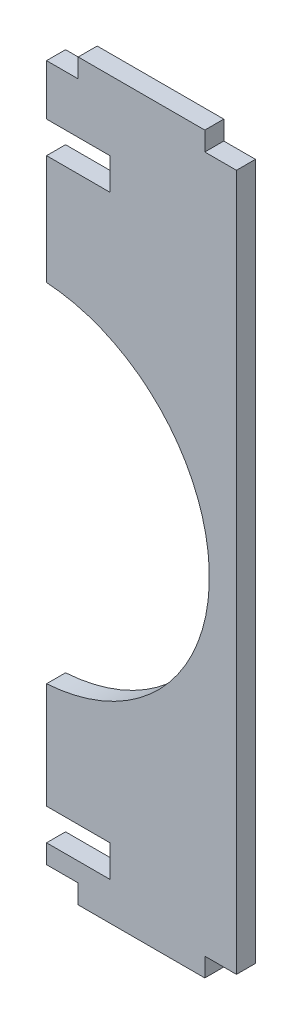
ISO-10303-21;
HEADER;
FILE_DESCRIPTION(('STEP AP214'),'2;1');
FILE_NAME('part.step','',(''),(''),'','','');
FILE_SCHEMA(('AUTOMOTIVE_DESIGN { 1 0 10303 214 1 1 1 1 }'));
ENDSEC;
DATA;
#1=APPLICATION_CONTEXT('core data for automotive mechanical design processes');
#2=APPLICATION_PROTOCOL_DEFINITION('international standard','automotive_design',2000,#1);
#3=PRODUCT_CONTEXT('',#1,'mechanical');
#4=PRODUCT('Part','Part','',(#3));
#5=PRODUCT_RELATED_PRODUCT_CATEGORY('part','',(#4));
#6=PRODUCT_DEFINITION_FORMATION('','',#4);
#7=PRODUCT_DEFINITION_CONTEXT('part definition',#1,'design');
#8=PRODUCT_DEFINITION('design','',#6,#7);
#9=PRODUCT_DEFINITION_SHAPE('','',#8);
#10=(LENGTH_UNIT() NAMED_UNIT(*) SI_UNIT(.MILLI.,.METRE.));
#11=(NAMED_UNIT(*) PLANE_ANGLE_UNIT() SI_UNIT($,.RADIAN.));
#12=(NAMED_UNIT(*) SI_UNIT($,.STERADIAN.) SOLID_ANGLE_UNIT());
#13=UNCERTAINTY_MEASURE_WITH_UNIT(LENGTH_MEASURE(1.E-05),#10,'distance_accuracy_value','');
#14=(GEOMETRIC_REPRESENTATION_CONTEXT(3) GLOBAL_UNCERTAINTY_ASSIGNED_CONTEXT((#13)) GLOBAL_UNIT_ASSIGNED_CONTEXT((#10,
#11,#12)) REPRESENTATION_CONTEXT('',''));
#15=CARTESIAN_POINT('',(0.,0.,0.));
#16=DIRECTION('',(0.,0.,1.));
#17=DIRECTION('',(1.,0.,0.));
#18=AXIS2_PLACEMENT_3D('',#15,#16,#17);
#19=CARTESIAN_POINT('',(-29.9999999999994,-3.00000000000271,3.));
#20=DIRECTION('',(1.,0.,0.));
#21=DIRECTION('',(0.,1.,0.));
#22=AXIS2_PLACEMENT_3D('',#19,#20,#21);
#23=PLANE('',#22);
#24=DIRECTION('',(0.,-1.,0.));
#25=VECTOR('',#24,1.);
#26=CARTESIAN_POINT('',(-29.9999999999994,-3.00000000000271,0.));
#27=LINE('',#26,#25);
#28=CARTESIAN_POINT('',(-29.9999999999994,-3.00000000000271,0.));
#29=VERTEX_POINT('',#28);
#30=CARTESIAN_POINT('',(-30.,-11.000000000005,0.));
#31=VERTEX_POINT('',#30);
#32=EDGE_CURVE('E208',#29,#31,#27,.T.);
#33=ORIENTED_EDGE('',*,*,#32,.T.);
#34=DIRECTION('',(0.,0.,1.));
#35=VECTOR('',#34,1.);
#36=CARTESIAN_POINT('',(-30.,-11.000000000005,0.));
#37=LINE('',#36,#35);
#38=CARTESIAN_POINT('',(-30.,-11.000000000005,3.));
#39=VERTEX_POINT('',#38);
#40=EDGE_CURVE('E289',#31,#39,#37,.T.);
#41=ORIENTED_EDGE('',*,*,#40,.T.);
#42=DIRECTION('',(0.,-1.,0.));
#43=VECTOR('',#42,1.);
#44=CARTESIAN_POINT('',(-29.9999999999994,-3.00000000000271,3.));
#45=LINE('',#44,#43);
#46=CARTESIAN_POINT('',(-29.9999999999994,-3.00000000000271,3.));
#47=VERTEX_POINT('',#46);
#48=EDGE_CURVE('E291',#47,#39,#45,.T.);
#49=ORIENTED_EDGE('',*,*,#48,.F.);
#50=DIRECTION('',(0.,0.,-1.));
#51=VECTOR('',#50,1.);
#52=CARTESIAN_POINT('',(-29.9999999999994,-3.00000000000271,3.));
#53=LINE('',#52,#51);
#54=EDGE_CURVE('E271',#47,#29,#53,.T.);
#55=ORIENTED_EDGE('',*,*,#54,.T.);
#56=EDGE_LOOP('',(#33,#41,#49,#55));
#57=FACE_BOUND('',#56,.T.);
#58=ADVANCED_FACE('F36',(#57),#23,.F.);
#59=CARTESIAN_POINT('',(-29.9999999999994,-113.000000000004,3.));
#60=DIRECTION('',(1.,0.,0.));
#61=DIRECTION('',(0.,1.,0.));
#62=AXIS2_PLACEMENT_3D('',#59,#60,#61);
#63=PLANE('',#62);
#64=DIRECTION('',(0.,-1.,0.));
#65=VECTOR('',#64,1.);
#66=CARTESIAN_POINT('',(-29.9999999999994,-113.000000000004,0.));
#67=LINE('',#66,#65);
#68=CARTESIAN_POINT('',(-29.9999999999997,-88.2435270209479,0.));
#69=VERTEX_POINT('',#68);
#70=CARTESIAN_POINT('',(-30.,-105.000000000003,0.));
#71=VERTEX_POINT('',#70);
#72=EDGE_CURVE('E218',#69,#71,#67,.T.);
#73=ORIENTED_EDGE('',*,*,#72,.T.);
#74=DIRECTION('',(0.,0.,1.));
#75=VECTOR('',#74,1.);
#76=CARTESIAN_POINT('',(-30.,-105.000000000003,0.));
#77=LINE('',#76,#75);
#78=CARTESIAN_POINT('',(-30.,-105.000000000003,3.));
#79=VERTEX_POINT('',#78);
#80=EDGE_CURVE('E321',#71,#79,#77,.T.);
#81=ORIENTED_EDGE('',*,*,#80,.T.);
#82=DIRECTION('',(0.,-1.,0.));
#83=VECTOR('',#82,1.);
#84=CARTESIAN_POINT('',(-29.9999999999994,-113.000000000004,3.));
#85=LINE('',#84,#83);
#86=CARTESIAN_POINT('',(-29.9999999999997,-88.2435270209479,3.));
#87=VERTEX_POINT('',#86);
#88=EDGE_CURVE('E301',#87,#79,#85,.T.);
#89=ORIENTED_EDGE('',*,*,#88,.F.);
#90=DIRECTION('',(0.,0.,-1.));
#91=VECTOR('',#90,1.);
#92=CARTESIAN_POINT('',(-29.9999999999997,-88.2435270209479,3.));
#93=LINE('',#92,#91);
#94=EDGE_CURVE('E266',#87,#69,#93,.T.);
#95=ORIENTED_EDGE('',*,*,#94,.T.);
#96=EDGE_LOOP('',(#73,#81,#89,#95));
#97=FACE_BOUND('',#96,.T.);
#98=ADVANCED_FACE('F413',(#97),#63,.F.);
#99=CARTESIAN_POINT('',(-5.00000000000001,0.,3.));
#100=DIRECTION('',(1.44009232012709E-13,-1.,0.));
#101=DIRECTION('',(1.,1.44009232012709E-13,0.));
#102=AXIS2_PLACEMENT_3D('',#99,#100,#101);
#103=PLANE('',#102);
#104=DIRECTION('',(-1.,-1.44009232012709E-13,0.));
#105=VECTOR('',#104,1.);
#106=CARTESIAN_POINT('',(-5.00000000000001,0.,0.));
#107=LINE('',#106,#105);
#108=CARTESIAN_POINT('',(-5.00000000000001,0.,0.));
#109=VERTEX_POINT('',#108);
#110=CARTESIAN_POINT('',(-24.9999999999994,-2.88018464025411E-12,0.));
#111=VERTEX_POINT('',#110);
#112=EDGE_CURVE('E319',#109,#111,#107,.T.);
#113=ORIENTED_EDGE('',*,*,#112,.T.);
#114=DIRECTION('',(0.,0.,-1.));
#115=VECTOR('',#114,1.);
#116=CARTESIAN_POINT('',(-24.9999999999994,-2.88018464025411E-12,3.));
#117=LINE('',#116,#115);
#118=CARTESIAN_POINT('',(-24.9999999999994,-2.88018464025411E-12,3.));
#119=VERTEX_POINT('',#118);
#120=EDGE_CURVE('E11',#119,#111,#117,.T.);
#121=ORIENTED_EDGE('',*,*,#120,.F.);
#122=DIRECTION('',(-1.,-1.44009232012709E-13,0.));
#123=VECTOR('',#122,1.);
#124=CARTESIAN_POINT('',(-5.00000000000001,0.,3.));
#125=LINE('',#124,#123);
#126=CARTESIAN_POINT('',(-5.00000000000001,0.,3.));
#127=VERTEX_POINT('',#126);
#128=EDGE_CURVE('E237',#127,#119,#125,.T.);
#129=ORIENTED_EDGE('',*,*,#128,.F.);
#130=DIRECTION('',(0.,0.,-1.));
#131=VECTOR('',#130,1.);
#132=CARTESIAN_POINT('',(-5.00000000000001,0.,3.));
#133=LINE('',#132,#131);
#134=EDGE_CURVE('E238',#127,#109,#133,.T.);
#135=ORIENTED_EDGE('',*,*,#134,.T.);
#136=EDGE_LOOP('',(#113,#121,#129,#135));
#137=FACE_BOUND('',#136,.T.);
#138=ADVANCED_FACE('F38',(#137),#103,.F.);
#139=CARTESIAN_POINT('',(-24.9999999999994,-2.88018464025411E-12,3.));
#140=DIRECTION('',(1.,0.,0.));
#141=DIRECTION('',(0.,0.,-1.));
#142=AXIS2_PLACEMENT_3D('',#139,#140,#141);
#143=PLANE('',#142);
#144=DIRECTION('',(0.,-1.,0.));
#145=VECTOR('',#144,1.);
#146=CARTESIAN_POINT('',(-24.9999999999994,-2.88018464025411E-12,0.));
#147=LINE('',#146,#145);
#148=CARTESIAN_POINT('',(-24.9999999999994,-3.00000000000271,0.));
#149=VERTEX_POINT('',#148);
#150=EDGE_CURVE('E212',#111,#149,#147,.T.);
#151=ORIENTED_EDGE('',*,*,#150,.T.);
#152=DIRECTION('',(0.,0.,-1.));
#153=VECTOR('',#152,1.);
#154=CARTESIAN_POINT('',(-24.9999999999994,-3.00000000000271,3.));
#155=LINE('',#154,#153);
#156=CARTESIAN_POINT('',(-24.9999999999994,-3.00000000000271,3.));
#157=VERTEX_POINT('',#156);
#158=EDGE_CURVE('E44',#157,#149,#155,.T.);
#159=ORIENTED_EDGE('',*,*,#158,.F.);
#160=DIRECTION('',(0.,-1.,0.));
#161=VECTOR('',#160,1.);
#162=CARTESIAN_POINT('',(-24.9999999999994,-2.88018464025411E-12,3.));
#163=LINE('',#162,#161);
#164=EDGE_CURVE('E324',#119,#157,#163,.T.);
#165=ORIENTED_EDGE('',*,*,#164,.F.);
#166=ORIENTED_EDGE('',*,*,#120,.T.);
#167=EDGE_LOOP('',(#151,#159,#165,#166));
#168=FACE_BOUND('',#167,.T.);
#169=ADVANCED_FACE('F322',(#168),#143,.F.);
#170=CARTESIAN_POINT('',(-24.9999999999994,-3.00000000000271,3.));
#171=DIRECTION('',(0.,-1.,0.));
#172=DIRECTION('',(1.,0.,0.));
#173=AXIS2_PLACEMENT_3D('',#170,#171,#172);
#174=PLANE('',#173);
#175=DIRECTION('',(-1.,0.,0.));
#176=VECTOR('',#175,1.);
#177=CARTESIAN_POINT('',(-24.9999999999994,-3.00000000000271,0.));
#178=LINE('',#177,#176);
#179=EDGE_CURVE('E209',#149,#29,#178,.T.);
#180=ORIENTED_EDGE('',*,*,#179,.T.);
#181=ORIENTED_EDGE('',*,*,#54,.F.);
#182=DIRECTION('',(-1.,0.,0.));
#183=VECTOR('',#182,1.);
#184=CARTESIAN_POINT('',(-24.9999999999994,-3.00000000000271,3.));
#185=LINE('',#184,#183);
#186=EDGE_CURVE('E280',#157,#47,#185,.T.);
#187=ORIENTED_EDGE('',*,*,#186,.F.);
#188=ORIENTED_EDGE('',*,*,#158,.T.);
#189=EDGE_LOOP('',(#180,#181,#187,#188));
#190=FACE_BOUND('',#189,.T.);
#191=ADVANCED_FACE('F278',(#190),#174,.F.);
#192=CARTESIAN_POINT('',(-30.,-16.000000000005,3.));
#193=VERTEX_POINT('',#192);
#194=CARTESIAN_POINT('',(-30.,-33.3589544228306,3.));
#195=VERTEX_POINT('',#194);
#196=EDGE_CURVE('E201',#193,#195,#45,.T.);
#197=ORIENTED_EDGE('',*,*,#196,.F.);
#198=DIRECTION('',(0.,0.,1.));
#199=VECTOR('',#198,1.);
#200=CARTESIAN_POINT('',(-30.,-16.000000000005,0.));
#201=LINE('',#200,#199);
#202=CARTESIAN_POINT('',(-30.,-16.000000000005,0.));
#203=VERTEX_POINT('',#202);
#204=EDGE_CURVE('E188',#203,#193,#201,.T.);
#205=ORIENTED_EDGE('',*,*,#204,.F.);
#206=CARTESIAN_POINT('',(-30.,-33.3589544228306,0.));
#207=VERTEX_POINT('',#206);
#208=EDGE_CURVE('E199',#203,#207,#27,.T.);
#209=ORIENTED_EDGE('',*,*,#208,.T.);
#210=DIRECTION('',(0.,0.,-1.));
#211=VECTOR('',#210,1.);
#212=CARTESIAN_POINT('',(-30.,-33.3589544228306,3.));
#213=LINE('',#212,#211);
#214=EDGE_CURVE('E269',#195,#207,#213,.T.);
#215=ORIENTED_EDGE('',*,*,#214,.F.);
#216=EDGE_LOOP('',(#197,#205,#209,#215));
#217=FACE_BOUND('',#216,.T.);
#218=ADVANCED_FACE('F197',(#217),#23,.F.);
#219=CARTESIAN_POINT('',(-31.7807084771232,-60.8012407218892,3.));
#220=DIRECTION('',(0.,0.,-1.));
#221=DIRECTION('',(-1.,0.,0.));
#222=AXIS2_PLACEMENT_3D('',#219,#220,#221);
#223=CYLINDRICAL_SURFACE('',#222,27.5);
#224=CARTESIAN_POINT('',(-31.7807084771232,-60.8012407218892,0.));
#225=DIRECTION('',(0.,0.,-1.));
#226=DIRECTION('',(1.,0.,0.));
#227=AXIS2_PLACEMENT_3D('',#224,#225,#226);
#228=CIRCLE('',#227,27.5);
#229=EDGE_CURVE('E207',#207,#69,#228,.T.);
#230=ORIENTED_EDGE('',*,*,#229,.T.);
#231=ORIENTED_EDGE('',*,*,#94,.F.);
#232=CARTESIAN_POINT('',(-31.7807084771232,-60.8012407218892,3.));
#233=DIRECTION('',(0.,0.,-1.));
#234=DIRECTION('',(1.,0.,0.));
#235=AXIS2_PLACEMENT_3D('',#232,#233,#234);
#236=CIRCLE('',#235,27.5);
#237=EDGE_CURVE('E294',#195,#87,#236,.T.);
#238=ORIENTED_EDGE('',*,*,#237,.F.);
#239=ORIENTED_EDGE('',*,*,#214,.T.);
#240=EDGE_LOOP('',(#230,#231,#238,#239));
#241=FACE_BOUND('',#240,.T.);
#242=ADVANCED_FACE('F423',(#241),#223,.F.);
#243=CARTESIAN_POINT('',(-30.,-110.000000000003,3.));
#244=VERTEX_POINT('',#243);
#245=CARTESIAN_POINT('',(-29.9999999999994,-113.000000000004,3.));
#246=VERTEX_POINT('',#245);
#247=EDGE_CURVE('E296',#244,#246,#85,.T.);
#248=ORIENTED_EDGE('',*,*,#247,.F.);
#249=DIRECTION('',(0.,0.,1.));
#250=VECTOR('',#249,1.);
#251=CARTESIAN_POINT('',(-30.,-110.000000000003,0.));
#252=LINE('',#251,#250);
#253=CARTESIAN_POINT('',(-30.,-110.000000000003,0.));
#254=VERTEX_POINT('',#253);
#255=EDGE_CURVE('E374',#254,#244,#252,.T.);
#256=ORIENTED_EDGE('',*,*,#255,.F.);
#257=CARTESIAN_POINT('',(-29.9999999999994,-113.000000000004,0.));
#258=VERTEX_POINT('',#257);
#259=EDGE_CURVE('E217',#254,#258,#67,.T.);
#260=ORIENTED_EDGE('',*,*,#259,.T.);
#261=DIRECTION('',(0.,0.,-1.));
#262=VECTOR('',#261,1.);
#263=CARTESIAN_POINT('',(-29.9999999999994,-113.000000000004,3.));
#264=LINE('',#263,#262);
#265=EDGE_CURVE('E263',#246,#258,#264,.T.);
#266=ORIENTED_EDGE('',*,*,#265,.F.);
#267=EDGE_LOOP('',(#248,#256,#260,#266));
#268=FACE_BOUND('',#267,.T.);
#269=ADVANCED_FACE('F372',(#268),#63,.F.);
#270=CARTESIAN_POINT('',(-24.9999999999994,-113.000000000004,3.));
#271=DIRECTION('',(0.,1.,0.));
#272=DIRECTION('',(0.,0.,1.));
#273=AXIS2_PLACEMENT_3D('',#270,#271,#272);
#274=PLANE('',#273);
#275=DIRECTION('',(1.,0.,0.));
#276=VECTOR('',#275,1.);
#277=CARTESIAN_POINT('',(-24.9999999999994,-113.000000000004,0.));
#278=LINE('',#277,#276);
#279=CARTESIAN_POINT('',(-24.9999999999994,-113.000000000004,0.));
#280=VERTEX_POINT('',#279);
#281=EDGE_CURVE('E221',#258,#280,#278,.T.);
#282=ORIENTED_EDGE('',*,*,#281,.T.);
#283=DIRECTION('',(0.,0.,-1.));
#284=VECTOR('',#283,1.);
#285=CARTESIAN_POINT('',(-24.9999999999994,-113.000000000004,3.));
#286=LINE('',#285,#284);
#287=CARTESIAN_POINT('',(-24.9999999999994,-113.000000000004,3.));
#288=VERTEX_POINT('',#287);
#289=EDGE_CURVE('E260',#288,#280,#286,.T.);
#290=ORIENTED_EDGE('',*,*,#289,.F.);
#291=DIRECTION('',(1.,0.,0.));
#292=VECTOR('',#291,1.);
#293=CARTESIAN_POINT('',(-24.9999999999994,-113.000000000004,3.));
#294=LINE('',#293,#292);
#295=EDGE_CURVE('E304',#246,#288,#294,.T.);
#296=ORIENTED_EDGE('',*,*,#295,.F.);
#297=ORIENTED_EDGE('',*,*,#265,.T.);
#298=EDGE_LOOP('',(#282,#290,#296,#297));
#299=FACE_BOUND('',#298,.T.);
#300=ADVANCED_FACE('F368',(#299),#274,.F.);
#301=CARTESIAN_POINT('',(-24.9999999999994,-116.000000000004,3.));
#302=DIRECTION('',(1.,0.,0.));
#303=DIRECTION('',(0.,1.,0.));
#304=AXIS2_PLACEMENT_3D('',#301,#302,#303);
#305=PLANE('',#304);
#306=DIRECTION('',(0.,-1.,0.));
#307=VECTOR('',#306,1.);
#308=CARTESIAN_POINT('',(-24.9999999999994,-116.000000000004,0.));
#309=LINE('',#308,#307);
#310=CARTESIAN_POINT('',(-24.9999999999994,-116.000000000004,0.));
#311=VERTEX_POINT('',#310);
#312=EDGE_CURVE('E223',#280,#311,#309,.T.);
#313=ORIENTED_EDGE('',*,*,#312,.T.);
#314=DIRECTION('',(0.,0.,-1.));
#315=VECTOR('',#314,1.);
#316=CARTESIAN_POINT('',(-24.9999999999994,-116.000000000004,3.));
#317=LINE('',#316,#315);
#318=CARTESIAN_POINT('',(-24.9999999999994,-116.000000000004,3.));
#319=VERTEX_POINT('',#318);
#320=EDGE_CURVE('E257',#319,#311,#317,.T.);
#321=ORIENTED_EDGE('',*,*,#320,.F.);
#322=DIRECTION('',(0.,-1.,0.));
#323=VECTOR('',#322,1.);
#324=CARTESIAN_POINT('',(-24.9999999999994,-116.000000000004,3.));
#325=LINE('',#324,#323);
#326=EDGE_CURVE('E306',#288,#319,#325,.T.);
#327=ORIENTED_EDGE('',*,*,#326,.F.);
#328=ORIENTED_EDGE('',*,*,#289,.T.);
#329=EDGE_LOOP('',(#313,#321,#327,#328));
#330=FACE_BOUND('',#329,.T.);
#331=ADVANCED_FACE('F363',(#330),#305,.F.);
#332=CARTESIAN_POINT('',(-4.99999999999936,-116.000000000004,3.));
#333=DIRECTION('',(0.,1.,0.));
#334=DIRECTION('',(0.,0.,1.));
#335=AXIS2_PLACEMENT_3D('',#332,#333,#334);
#336=PLANE('',#335);
#337=DIRECTION('',(1.,0.,0.));
#338=VECTOR('',#337,1.);
#339=CARTESIAN_POINT('',(-4.99999999999936,-116.000000000004,0.));
#340=LINE('',#339,#338);
#341=CARTESIAN_POINT('',(-4.99999999999936,-116.000000000004,0.));
#342=VERTEX_POINT('',#341);
#343=EDGE_CURVE('E225',#311,#342,#340,.T.);
#344=ORIENTED_EDGE('',*,*,#343,.T.);
#345=DIRECTION('',(0.,0.,-1.));
#346=VECTOR('',#345,1.);
#347=CARTESIAN_POINT('',(-4.99999999999936,-116.000000000004,3.));
#348=LINE('',#347,#346);
#349=CARTESIAN_POINT('',(-4.99999999999936,-116.000000000004,3.));
#350=VERTEX_POINT('',#349);
#351=EDGE_CURVE('E254',#350,#342,#348,.T.);
#352=ORIENTED_EDGE('',*,*,#351,.F.);
#353=DIRECTION('',(1.,0.,0.));
#354=VECTOR('',#353,1.);
#355=CARTESIAN_POINT('',(-4.99999999999936,-116.000000000004,3.));
#356=LINE('',#355,#354);
#357=EDGE_CURVE('E308',#319,#350,#356,.T.);
#358=ORIENTED_EDGE('',*,*,#357,.F.);
#359=ORIENTED_EDGE('',*,*,#320,.T.);
#360=EDGE_LOOP('',(#344,#352,#358,#359));
#361=FACE_BOUND('',#360,.T.);
#362=ADVANCED_FACE('F357',(#361),#336,.F.);
#363=CARTESIAN_POINT('',(-4.99999999999936,-113.00815233073,3.));
#364=DIRECTION('',(-1.,0.,0.));
#365=DIRECTION('',(0.,0.,1.));
#366=AXIS2_PLACEMENT_3D('',#363,#364,#365);
#367=PLANE('',#366);
#368=DIRECTION('',(0.,1.,0.));
#369=VECTOR('',#368,1.);
#370=CARTESIAN_POINT('',(-4.99999999999936,-113.00815233073,0.));
#371=LINE('',#370,#369);
#372=CARTESIAN_POINT('',(-4.99999999999936,-113.00815233073,0.));
#373=VERTEX_POINT('',#372);
#374=EDGE_CURVE('E227',#342,#373,#371,.T.);
#375=ORIENTED_EDGE('',*,*,#374,.T.);
#376=DIRECTION('',(0.,0.,-1.));
#377=VECTOR('',#376,1.);
#378=CARTESIAN_POINT('',(-4.99999999999936,-113.00815233073,3.));
#379=LINE('',#378,#377);
#380=CARTESIAN_POINT('',(-4.99999999999936,-113.00815233073,3.));
#381=VERTEX_POINT('',#380);
#382=EDGE_CURVE('E251',#381,#373,#379,.T.);
#383=ORIENTED_EDGE('',*,*,#382,.F.);
#384=DIRECTION('',(0.,1.,0.));
#385=VECTOR('',#384,1.);
#386=CARTESIAN_POINT('',(-4.99999999999936,-113.00815233073,3.));
#387=LINE('',#386,#385);
#388=EDGE_CURVE('E310',#350,#381,#387,.T.);
#389=ORIENTED_EDGE('',*,*,#388,.F.);
#390=ORIENTED_EDGE('',*,*,#351,.T.);
#391=EDGE_LOOP('',(#375,#383,#389,#390));
#392=FACE_BOUND('',#391,.T.);
#393=ADVANCED_FACE('F353',(#392),#367,.F.);
#394=CARTESIAN_POINT('',(6.60014848764129E-13,-113.00815233073,3.));
#395=DIRECTION('',(0.,1.,0.));
#396=DIRECTION('',(-1.,0.,0.));
#397=AXIS2_PLACEMENT_3D('',#394,#395,#396);
#398=PLANE('',#397);
#399=DIRECTION('',(1.,0.,0.));
#400=VECTOR('',#399,1.);
#401=CARTESIAN_POINT('',(6.60014848764129E-13,-113.00815233073,0.));
#402=LINE('',#401,#400);
#403=CARTESIAN_POINT('',(6.60014848764129E-13,-113.00815233073,0.));
#404=VERTEX_POINT('',#403);
#405=EDGE_CURVE('E229',#373,#404,#402,.T.);
#406=ORIENTED_EDGE('',*,*,#405,.T.);
#407=DIRECTION('',(0.,0.,-1.));
#408=VECTOR('',#407,1.);
#409=CARTESIAN_POINT('',(6.60014848764129E-13,-113.00815233073,3.));
#410=LINE('',#409,#408);
#411=CARTESIAN_POINT('',(6.60014848764129E-13,-113.00815233073,3.));
#412=VERTEX_POINT('',#411);
#413=EDGE_CURVE('E248',#412,#404,#410,.T.);
#414=ORIENTED_EDGE('',*,*,#413,.F.);
#415=DIRECTION('',(1.,0.,0.));
#416=VECTOR('',#415,1.);
#417=CARTESIAN_POINT('',(6.60014848764129E-13,-113.00815233073,3.));
#418=LINE('',#417,#416);
#419=EDGE_CURVE('E312',#381,#412,#418,.T.);
#420=ORIENTED_EDGE('',*,*,#419,.F.);
#421=ORIENTED_EDGE('',*,*,#382,.T.);
#422=EDGE_LOOP('',(#406,#414,#420,#421));
#423=FACE_BOUND('',#422,.T.);
#424=ADVANCED_FACE('F348',(#423),#398,.F.);
#425=CARTESIAN_POINT('',(6.26235174827627E-13,-3.00000000000288,3.));
#426=DIRECTION('',(-1.,0.,0.));
#427=DIRECTION('',(0.,-1.,0.));
#428=AXIS2_PLACEMENT_3D('',#425,#426,#427);
#429=PLANE('',#428);
#430=DIRECTION('',(0.,1.,0.));
#431=VECTOR('',#430,1.);
#432=CARTESIAN_POINT('',(6.26235174827627E-13,-3.00000000000288,0.));
#433=LINE('',#432,#431);
#434=CARTESIAN_POINT('',(6.26235174827627E-13,-3.00000000000288,0.));
#435=VERTEX_POINT('',#434);
#436=EDGE_CURVE('E231',#404,#435,#433,.T.);
#437=ORIENTED_EDGE('',*,*,#436,.T.);
#438=DIRECTION('',(0.,0.,-1.));
#439=VECTOR('',#438,1.);
#440=CARTESIAN_POINT('',(6.26235174827627E-13,-3.00000000000288,3.));
#441=LINE('',#440,#439);
#442=CARTESIAN_POINT('',(6.26235174827627E-13,-3.00000000000288,3.));
#443=VERTEX_POINT('',#442);
#444=EDGE_CURVE('E245',#443,#435,#441,.T.);
#445=ORIENTED_EDGE('',*,*,#444,.F.);
#446=DIRECTION('',(0.,1.,0.));
#447=VECTOR('',#446,1.);
#448=CARTESIAN_POINT('',(6.26235174827627E-13,-3.00000000000288,3.));
#449=LINE('',#448,#447);
#450=EDGE_CURVE('E314',#412,#443,#449,.T.);
#451=ORIENTED_EDGE('',*,*,#450,.F.);
#452=ORIENTED_EDGE('',*,*,#413,.T.);
#453=EDGE_LOOP('',(#437,#445,#451,#452));
#454=FACE_BOUND('',#453,.T.);
#455=ADVANCED_FACE('F342',(#454),#429,.F.);
#456=CARTESIAN_POINT('',(-5.,-3.00000000000271,3.));
#457=DIRECTION('',(0.,-1.,0.));
#458=DIRECTION('',(1.,0.,0.));
#459=AXIS2_PLACEMENT_3D('',#456,#457,#458);
#460=PLANE('',#459);
#461=DIRECTION('',(-1.,0.,0.));
#462=VECTOR('',#461,1.);
#463=CARTESIAN_POINT('',(-5.,-3.00000000000271,0.));
#464=LINE('',#463,#462);
#465=CARTESIAN_POINT('',(-5.,-3.00000000000271,0.));
#466=VERTEX_POINT('',#465);
#467=EDGE_CURVE('E233',#435,#466,#464,.T.);
#468=ORIENTED_EDGE('',*,*,#467,.T.);
#469=DIRECTION('',(0.,0.,-1.));
#470=VECTOR('',#469,1.);
#471=CARTESIAN_POINT('',(-5.,-3.00000000000271,3.));
#472=LINE('',#471,#470);
#473=CARTESIAN_POINT('',(-5.,-3.00000000000271,3.));
#474=VERTEX_POINT('',#473);
#475=EDGE_CURVE('E241',#474,#466,#472,.T.);
#476=ORIENTED_EDGE('',*,*,#475,.F.);
#477=DIRECTION('',(-1.,0.,0.));
#478=VECTOR('',#477,1.);
#479=CARTESIAN_POINT('',(-5.,-3.00000000000271,3.));
#480=LINE('',#479,#478);
#481=EDGE_CURVE('E316',#443,#474,#480,.T.);
#482=ORIENTED_EDGE('',*,*,#481,.F.);
#483=ORIENTED_EDGE('',*,*,#444,.T.);
#484=EDGE_LOOP('',(#468,#476,#482,#483));
#485=FACE_BOUND('',#484,.T.);
#486=ADVANCED_FACE('F338',(#485),#460,.F.);
#487=CARTESIAN_POINT('',(-5.00000000000001,0.,3.));
#488=DIRECTION('',(-1.,0.,0.));
#489=DIRECTION('',(0.,-1.,0.));
#490=AXIS2_PLACEMENT_3D('',#487,#488,#489);
#491=PLANE('',#490);
#492=DIRECTION('',(0.,1.,0.));
#493=VECTOR('',#492,1.);
#494=CARTESIAN_POINT('',(-5.00000000000001,0.,0.));
#495=LINE('',#494,#493);
#496=EDGE_CURVE('E235',#466,#109,#495,.T.);
#497=ORIENTED_EDGE('',*,*,#496,.T.);
#498=ORIENTED_EDGE('',*,*,#134,.F.);
#499=DIRECTION('',(0.,1.,0.));
#500=VECTOR('',#499,1.);
#501=CARTESIAN_POINT('',(-5.00000000000001,0.,3.));
#502=LINE('',#501,#500);
#503=EDGE_CURVE('E242',#474,#127,#502,.T.);
#504=ORIENTED_EDGE('',*,*,#503,.F.);
#505=ORIENTED_EDGE('',*,*,#475,.T.);
#506=EDGE_LOOP('',(#497,#498,#504,#505));
#507=FACE_BOUND('',#506,.T.);
#508=ADVANCED_FACE('F333',(#507),#491,.F.);
#509=CARTESIAN_POINT('',(-31.7807084771232,-60.8012407218892,3.));
#510=DIRECTION('',(0.,0.,1.));
#511=DIRECTION('',(1.,0.,0.));
#512=AXIS2_PLACEMENT_3D('',#509,#510,#511);
#513=PLANE('',#512);
#514=DIRECTION('',(-1.,0.,0.));
#515=VECTOR('',#514,1.);
#516=CARTESIAN_POINT('',(-30.,-11.000000000005,3.));
#517=LINE('',#516,#515);
#518=CARTESIAN_POINT('',(-20.,-11.000000000005,3.));
#519=VERTEX_POINT('',#518);
#520=EDGE_CURVE('E193',#519,#39,#517,.T.);
#521=ORIENTED_EDGE('',*,*,#520,.F.);
#522=DIRECTION('',(0.,1.,0.));
#523=VECTOR('',#522,1.);
#524=CARTESIAN_POINT('',(-20.,-16.000000000005,3.));
#525=LINE('',#524,#523);
#526=CARTESIAN_POINT('',(-20.,-16.000000000005,3.));
#527=VERTEX_POINT('',#526);
#528=EDGE_CURVE('E528',#527,#519,#525,.T.);
#529=ORIENTED_EDGE('',*,*,#528,.F.);
#530=DIRECTION('',(1.,0.,0.));
#531=VECTOR('',#530,1.);
#532=CARTESIAN_POINT('',(-30.,-16.000000000005,3.));
#533=LINE('',#532,#531);
#534=EDGE_CURVE('E530',#193,#527,#533,.T.);
#535=ORIENTED_EDGE('',*,*,#534,.F.);
#536=ORIENTED_EDGE('',*,*,#196,.T.);
#537=ORIENTED_EDGE('',*,*,#237,.T.);
#538=ORIENTED_EDGE('',*,*,#88,.T.);
#539=DIRECTION('',(-1.,0.,0.));
#540=VECTOR('',#539,1.);
#541=CARTESIAN_POINT('',(-30.,-105.000000000003,3.));
#542=LINE('',#541,#540);
#543=CARTESIAN_POINT('',(-20.,-105.000000000003,3.));
#544=VERTEX_POINT('',#543);
#545=EDGE_CURVE('E379',#544,#79,#542,.T.);
#546=ORIENTED_EDGE('',*,*,#545,.F.);
#547=DIRECTION('',(0.,1.,0.));
#548=VECTOR('',#547,1.);
#549=CARTESIAN_POINT('',(-20.,-110.000000000003,3.));
#550=LINE('',#549,#548);
#551=CARTESIAN_POINT('',(-20.,-110.000000000003,3.));
#552=VERTEX_POINT('',#551);
#553=EDGE_CURVE('E383',#552,#544,#550,.T.);
#554=ORIENTED_EDGE('',*,*,#553,.F.);
#555=DIRECTION('',(1.,0.,0.));
#556=VECTOR('',#555,1.);
#557=CARTESIAN_POINT('',(-30.,-110.000000000003,3.));
#558=LINE('',#557,#556);
#559=EDGE_CURVE('E388',#244,#552,#558,.T.);
#560=ORIENTED_EDGE('',*,*,#559,.F.);
#561=ORIENTED_EDGE('',*,*,#247,.T.);
#562=ORIENTED_EDGE('',*,*,#295,.T.);
#563=ORIENTED_EDGE('',*,*,#326,.T.);
#564=ORIENTED_EDGE('',*,*,#357,.T.);
#565=ORIENTED_EDGE('',*,*,#388,.T.);
#566=ORIENTED_EDGE('',*,*,#419,.T.);
#567=ORIENTED_EDGE('',*,*,#450,.T.);
#568=ORIENTED_EDGE('',*,*,#481,.T.);
#569=ORIENTED_EDGE('',*,*,#503,.T.);
#570=ORIENTED_EDGE('',*,*,#128,.T.);
#571=ORIENTED_EDGE('',*,*,#164,.T.);
#572=ORIENTED_EDGE('',*,*,#186,.T.);
#573=ORIENTED_EDGE('',*,*,#48,.T.);
#574=EDGE_LOOP('',(#521,#529,#535,#536,#537,#538,#546,#554,#560,#561,#562,#563,#564,#565,#566,
#567,#568,#569,#570,#571,#572,#573));
#575=FACE_BOUND('',#574,.T.);
#576=ADVANCED_FACE('F400',(#575),#513,.T.);
#577=CARTESIAN_POINT('',(-31.7807084771232,-60.8012407218892,0.));
#578=DIRECTION('',(0.,0.,1.));
#579=DIRECTION('',(1.,0.,0.));
#580=AXIS2_PLACEMENT_3D('',#577,#578,#579);
#581=PLANE('',#580);
#582=DIRECTION('',(0.,1.,0.));
#583=VECTOR('',#582,1.);
#584=CARTESIAN_POINT('',(-20.,-16.000000000005,0.));
#585=LINE('',#584,#583);
#586=CARTESIAN_POINT('',(-20.,-16.000000000005,0.));
#587=VERTEX_POINT('',#586);
#588=CARTESIAN_POINT('',(-20.,-11.000000000005,0.));
#589=VERTEX_POINT('',#588);
#590=EDGE_CURVE('E51',#587,#589,#585,.T.);
#591=ORIENTED_EDGE('',*,*,#590,.T.);
#592=DIRECTION('',(-1.,0.,0.));
#593=VECTOR('',#592,1.);
#594=CARTESIAN_POINT('',(-30.,-11.000000000005,0.));
#595=LINE('',#594,#593);
#596=EDGE_CURVE('E202',#589,#31,#595,.T.);
#597=ORIENTED_EDGE('',*,*,#596,.T.);
#598=ORIENTED_EDGE('',*,*,#32,.F.);
#599=ORIENTED_EDGE('',*,*,#179,.F.);
#600=ORIENTED_EDGE('',*,*,#150,.F.);
#601=ORIENTED_EDGE('',*,*,#112,.F.);
#602=ORIENTED_EDGE('',*,*,#496,.F.);
#603=ORIENTED_EDGE('',*,*,#467,.F.);
#604=ORIENTED_EDGE('',*,*,#436,.F.);
#605=ORIENTED_EDGE('',*,*,#405,.F.);
#606=ORIENTED_EDGE('',*,*,#374,.F.);
#607=ORIENTED_EDGE('',*,*,#343,.F.);
#608=ORIENTED_EDGE('',*,*,#312,.F.);
#609=ORIENTED_EDGE('',*,*,#281,.F.);
#610=ORIENTED_EDGE('',*,*,#259,.F.);
#611=DIRECTION('',(1.,0.,0.));
#612=VECTOR('',#611,1.);
#613=CARTESIAN_POINT('',(-30.,-110.000000000003,0.));
#614=LINE('',#613,#612);
#615=CARTESIAN_POINT('',(-20.,-110.000000000003,0.));
#616=VERTEX_POINT('',#615);
#617=EDGE_CURVE('E376',#254,#616,#614,.T.);
#618=ORIENTED_EDGE('',*,*,#617,.T.);
#619=DIRECTION('',(0.,1.,0.));
#620=VECTOR('',#619,1.);
#621=CARTESIAN_POINT('',(-20.,-110.000000000003,0.));
#622=LINE('',#621,#620);
#623=CARTESIAN_POINT('',(-20.,-105.000000000003,0.));
#624=VERTEX_POINT('',#623);
#625=EDGE_CURVE('E59',#616,#624,#622,.T.);
#626=ORIENTED_EDGE('',*,*,#625,.T.);
#627=DIRECTION('',(-1.,0.,0.));
#628=VECTOR('',#627,1.);
#629=CARTESIAN_POINT('',(-30.,-105.000000000003,0.));
#630=LINE('',#629,#628);
#631=EDGE_CURVE('E381',#624,#71,#630,.T.);
#632=ORIENTED_EDGE('',*,*,#631,.T.);
#633=ORIENTED_EDGE('',*,*,#72,.F.);
#634=ORIENTED_EDGE('',*,*,#229,.F.);
#635=ORIENTED_EDGE('',*,*,#208,.F.);
#636=DIRECTION('',(1.,0.,0.));
#637=VECTOR('',#636,1.);
#638=CARTESIAN_POINT('',(-30.,-16.000000000005,0.));
#639=LINE('',#638,#637);
#640=EDGE_CURVE('E184',#203,#587,#639,.T.);
#641=ORIENTED_EDGE('',*,*,#640,.T.);
#642=EDGE_LOOP('',(#591,#597,#598,#599,#600,#601,#602,#603,#604,#605,#606,#607,#608,#609,#610,
#618,#626,#632,#633,#634,#635,#641));
#643=FACE_BOUND('',#642,.T.);
#644=ADVANCED_FACE('F205',(#643),#581,.F.);
#645=CARTESIAN_POINT('',(-30.,-105.000000000003,0.));
#646=DIRECTION('',(0.,1.,0.));
#647=DIRECTION('',(0.,0.,1.));
#648=AXIS2_PLACEMENT_3D('',#645,#646,#647);
#649=PLANE('',#648);
#650=ORIENTED_EDGE('',*,*,#545,.T.);
#651=ORIENTED_EDGE('',*,*,#80,.F.);
#652=ORIENTED_EDGE('',*,*,#631,.F.);
#653=DIRECTION('',(0.,0.,1.));
#654=VECTOR('',#653,1.);
#655=CARTESIAN_POINT('',(-20.,-105.000000000003,0.));
#656=LINE('',#655,#654);
#657=EDGE_CURVE('E395',#624,#544,#656,.T.);
#658=ORIENTED_EDGE('',*,*,#657,.T.);
#659=EDGE_LOOP('',(#650,#651,#652,#658));
#660=FACE_BOUND('',#659,.T.);
#661=ADVANCED_FACE('F408',(#660),#649,.F.);
#662=CARTESIAN_POINT('',(-20.,-110.000000000003,0.));
#663=DIRECTION('',(1.,0.,0.));
#664=DIRECTION('',(0.,0.,-1.));
#665=AXIS2_PLACEMENT_3D('',#662,#663,#664);
#666=PLANE('',#665);
#667=ORIENTED_EDGE('',*,*,#553,.T.);
#668=ORIENTED_EDGE('',*,*,#657,.F.);
#669=ORIENTED_EDGE('',*,*,#625,.F.);
#670=DIRECTION('',(0.,0.,1.));
#671=VECTOR('',#670,1.);
#672=CARTESIAN_POINT('',(-20.,-110.000000000003,0.));
#673=LINE('',#672,#671);
#674=EDGE_CURVE('E397',#616,#552,#673,.T.);
#675=ORIENTED_EDGE('',*,*,#674,.T.);
#676=EDGE_LOOP('',(#667,#668,#669,#675));
#677=FACE_BOUND('',#676,.T.);
#678=ADVANCED_FACE('F479',(#677),#666,.F.);
#679=CARTESIAN_POINT('',(-30.,-110.000000000003,0.));
#680=DIRECTION('',(0.,-1.,0.));
#681=DIRECTION('',(0.,0.,-1.));
#682=AXIS2_PLACEMENT_3D('',#679,#680,#681);
#683=PLANE('',#682);
#684=ORIENTED_EDGE('',*,*,#559,.T.);
#685=ORIENTED_EDGE('',*,*,#674,.F.);
#686=ORIENTED_EDGE('',*,*,#617,.F.);
#687=ORIENTED_EDGE('',*,*,#255,.T.);
#688=EDGE_LOOP('',(#684,#685,#686,#687));
#689=FACE_BOUND('',#688,.T.);
#690=ADVANCED_FACE('F489',(#689),#683,.F.);
#691=CARTESIAN_POINT('',(-30.,-11.000000000005,0.));
#692=DIRECTION('',(0.,1.,0.));
#693=DIRECTION('',(0.,0.,1.));
#694=AXIS2_PLACEMENT_3D('',#691,#692,#693);
#695=PLANE('',#694);
#696=ORIENTED_EDGE('',*,*,#520,.T.);
#697=ORIENTED_EDGE('',*,*,#40,.F.);
#698=ORIENTED_EDGE('',*,*,#596,.F.);
#699=DIRECTION('',(0.,0.,1.));
#700=VECTOR('',#699,1.);
#701=CARTESIAN_POINT('',(-20.,-11.000000000005,0.));
#702=LINE('',#701,#700);
#703=EDGE_CURVE('E529',#589,#519,#702,.T.);
#704=ORIENTED_EDGE('',*,*,#703,.T.);
#705=EDGE_LOOP('',(#696,#697,#698,#704));
#706=FACE_BOUND('',#705,.T.);
#707=ADVANCED_FACE('F498',(#706),#695,.F.);
#708=CARTESIAN_POINT('',(-20.,-16.000000000005,0.));
#709=DIRECTION('',(1.,0.,0.));
#710=DIRECTION('',(0.,0.,-1.));
#711=AXIS2_PLACEMENT_3D('',#708,#709,#710);
#712=PLANE('',#711);
#713=ORIENTED_EDGE('',*,*,#528,.T.);
#714=ORIENTED_EDGE('',*,*,#703,.F.);
#715=ORIENTED_EDGE('',*,*,#590,.F.);
#716=DIRECTION('',(0.,0.,1.));
#717=VECTOR('',#716,1.);
#718=CARTESIAN_POINT('',(-20.,-16.000000000005,0.));
#719=LINE('',#718,#717);
#720=EDGE_CURVE('E190',#587,#527,#719,.T.);
#721=ORIENTED_EDGE('',*,*,#720,.T.);
#722=EDGE_LOOP('',(#713,#714,#715,#721));
#723=FACE_BOUND('',#722,.T.);
#724=ADVANCED_FACE('F506',(#723),#712,.F.);
#725=CARTESIAN_POINT('',(-30.,-16.000000000005,0.));
#726=DIRECTION('',(0.,-1.,0.));
#727=DIRECTION('',(0.,0.,-1.));
#728=AXIS2_PLACEMENT_3D('',#725,#726,#727);
#729=PLANE('',#728);
#730=ORIENTED_EDGE('',*,*,#534,.T.);
#731=ORIENTED_EDGE('',*,*,#720,.F.);
#732=ORIENTED_EDGE('',*,*,#640,.F.);
#733=ORIENTED_EDGE('',*,*,#204,.T.);
#734=EDGE_LOOP('',(#730,#731,#732,#733));
#735=FACE_BOUND('',#734,.T.);
#736=ADVANCED_FACE('F187',(#735),#729,.F.);
#737=CLOSED_SHELL('',(#58,#98,#138,#169,#191,#218,#242,#269,#300,#331,#362,#393,#424,#455,#486,
#508,#576,#644,#661,#678,#690,#707,#724,#736));
#738=MANIFOLD_SOLID_BREP('B2',#737);
#739=ADVANCED_BREP_SHAPE_REPRESENTATION('',(#18,#738),#14);
#740=SHAPE_DEFINITION_REPRESENTATION(#9,#739);
ENDSEC;
END-ISO-10303-21;
